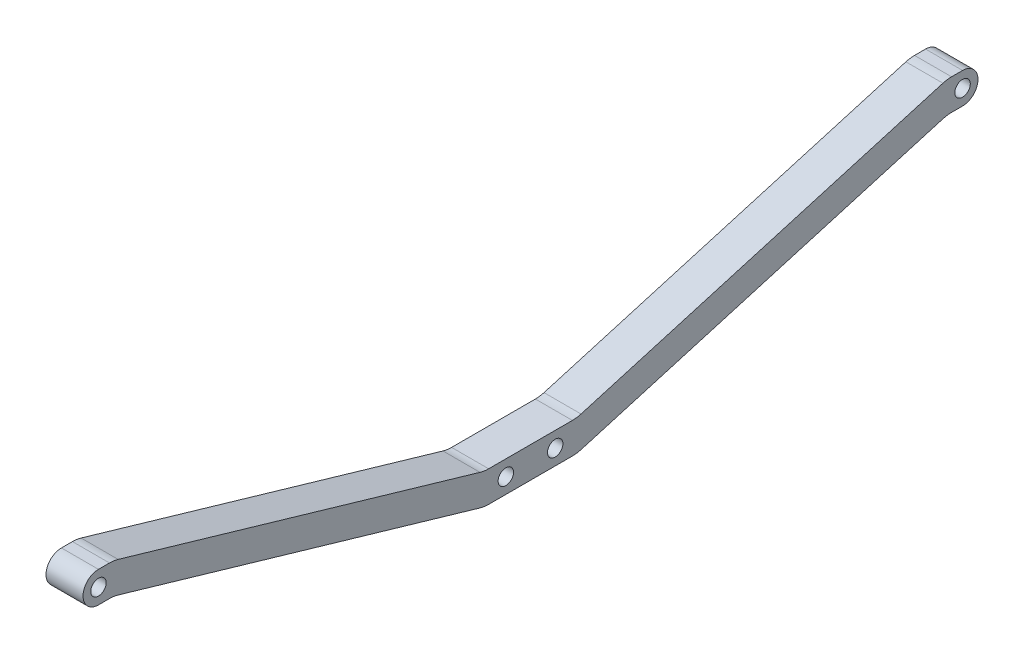
ISO-10303-21;
HEADER;
FILE_DESCRIPTION(('STEP AP214'),'2;1');
FILE_NAME('part.step','',(''),(''),'','','');
FILE_SCHEMA(('AUTOMOTIVE_DESIGN { 1 0 10303 214 1 1 1 1 }'));
ENDSEC;
DATA;
#1=APPLICATION_CONTEXT('core data for automotive mechanical design processes');
#2=APPLICATION_PROTOCOL_DEFINITION('international standard','automotive_design',2000,#1);
#3=PRODUCT_CONTEXT('',#1,'mechanical');
#4=PRODUCT('Part','Part','',(#3));
#5=PRODUCT_RELATED_PRODUCT_CATEGORY('part','',(#4));
#6=PRODUCT_DEFINITION_FORMATION('','',#4);
#7=PRODUCT_DEFINITION_CONTEXT('part definition',#1,'design');
#8=PRODUCT_DEFINITION('design','',#6,#7);
#9=PRODUCT_DEFINITION_SHAPE('','',#8);
#10=(LENGTH_UNIT() NAMED_UNIT(*) SI_UNIT(.MILLI.,.METRE.));
#11=(NAMED_UNIT(*) PLANE_ANGLE_UNIT() SI_UNIT($,.RADIAN.));
#12=(NAMED_UNIT(*) SI_UNIT($,.STERADIAN.) SOLID_ANGLE_UNIT());
#13=UNCERTAINTY_MEASURE_WITH_UNIT(LENGTH_MEASURE(1.E-05),#10,'distance_accuracy_value','');
#14=(GEOMETRIC_REPRESENTATION_CONTEXT(3) GLOBAL_UNCERTAINTY_ASSIGNED_CONTEXT((#13)) GLOBAL_UNIT_ASSIGNED_CONTEXT((#10,
#11,#12)) REPRESENTATION_CONTEXT('',''));
#15=CARTESIAN_POINT('',(0.,0.,0.));
#16=DIRECTION('',(0.,0.,1.));
#17=DIRECTION('',(1.,0.,0.));
#18=AXIS2_PLACEMENT_3D('',#15,#16,#17);
#19=CARTESIAN_POINT('',(12.,0.,-140.));
#20=DIRECTION('',(1.,0.,0.));
#21=DIRECTION('',(0.,0.,-1.));
#22=AXIS2_PLACEMENT_3D('',#19,#20,#21);
#23=PLANE('',#22);
#24=CARTESIAN_POINT('',(12.,0.,140.));
#25=DIRECTION('',(1.,0.,0.));
#26=DIRECTION('',(0.,0.,-1.));
#27=AXIS2_PLACEMENT_3D('',#24,#25,#26);
#28=CIRCLE('',#27,2.5);
#29=CARTESIAN_POINT('',(12.,0.,137.5));
#30=VERTEX_POINT('',#29);
#31=EDGE_CURVE('E684',#30,#30,#28,.T.);
#32=ORIENTED_EDGE('',*,*,#31,.F.);
#33=EDGE_LOOP('',(#32));
#34=FACE_BOUND('',#33,.T.);
#35=CARTESIAN_POINT('',(12.,-35.,8.));
#36=DIRECTION('',(1.,0.,0.));
#37=DIRECTION('',(0.,0.,-1.));
#38=AXIS2_PLACEMENT_3D('',#35,#36,#37);
#39=CIRCLE('',#38,2.5);
#40=CARTESIAN_POINT('',(12.,-35.,5.5));
#41=VERTEX_POINT('',#40);
#42=EDGE_CURVE('E357',#41,#41,#39,.T.);
#43=ORIENTED_EDGE('',*,*,#42,.F.);
#44=EDGE_LOOP('',(#43));
#45=FACE_BOUND('',#44,.T.);
#46=DIRECTION('',(0.,0.,-1.));
#47=VECTOR('',#46,1.);
#48=CARTESIAN_POINT('',(12.,-40.,15.));
#49=LINE('',#48,#47);
#50=CARTESIAN_POINT('',(12.,-40.,13.5714285714286));
#51=VERTEX_POINT('',#50);
#52=CARTESIAN_POINT('',(12.,-40.,-13.5714285714286));
#53=VERTEX_POINT('',#52);
#54=EDGE_CURVE('E339',#51,#53,#49,.T.);
#55=ORIENTED_EDGE('',*,*,#54,.T.);
#56=CARTESIAN_POINT('',(12.,-30.,-13.5714285714286));
#57=DIRECTION('',(1.,0.,0.));
#58=DIRECTION('',(0.,0.,-1.));
#59=AXIS2_PLACEMENT_3D('',#56,#57,#58);
#60=CIRCLE('',#59,10.);
#61=CARTESIAN_POINT('',(12.,-39.6,-16.3714285714286));
#62=VERTEX_POINT('',#61);
#63=EDGE_CURVE('E271',#53,#62,#60,.T.);
#64=ORIENTED_EDGE('',*,*,#63,.T.);
#65=DIRECTION('',(0.,0.28,-0.96));
#66=VECTOR('',#65,1.);
#67=CARTESIAN_POINT('',(12.,-40.,-15.));
#68=LINE('',#67,#66);
#69=CARTESIAN_POINT('',(12.,-5.39999999999999,-133.628571428571));
#70=VERTEX_POINT('',#69);
#71=EDGE_CURVE('E343',#62,#70,#68,.T.);
#72=ORIENTED_EDGE('',*,*,#71,.T.);
#73=CARTESIAN_POINT('',(12.,-15.,-136.428571428571));
#74=DIRECTION('',(1.,0.,0.));
#75=DIRECTION('',(0.,0.,-1.));
#76=AXIS2_PLACEMENT_3D('',#73,#74,#75);
#77=CIRCLE('',#76,10.);
#78=CARTESIAN_POINT('',(12.,-4.99999999999999,-136.428571428571));
#79=VERTEX_POINT('',#78);
#80=EDGE_CURVE('E55',#70,#79,#77,.F.);
#81=ORIENTED_EDGE('',*,*,#80,.T.);
#82=DIRECTION('',(0.,0.,-1.));
#83=VECTOR('',#82,1.);
#84=CARTESIAN_POINT('',(12.,-4.99999999999999,-140.));
#85=LINE('',#84,#83);
#86=CARTESIAN_POINT('',(12.,-4.99999999999999,-140.));
#87=VERTEX_POINT('',#86);
#88=EDGE_CURVE('E196',#79,#87,#85,.T.);
#89=ORIENTED_EDGE('',*,*,#88,.T.);
#90=CARTESIAN_POINT('',(12.,0.,-140.));
#91=DIRECTION('',(1.,0.,0.));
#92=DIRECTION('',(0.,0.,-1.));
#93=AXIS2_PLACEMENT_3D('',#90,#91,#92);
#94=CIRCLE('',#93,4.99999999999999);
#95=CARTESIAN_POINT('',(12.,4.99999999999999,-140.));
#96=VERTEX_POINT('',#95);
#97=EDGE_CURVE('E191',#87,#96,#94,.T.);
#98=ORIENTED_EDGE('',*,*,#97,.T.);
#99=DIRECTION('',(0.,0.,1.));
#100=VECTOR('',#99,1.);
#101=CARTESIAN_POINT('',(12.,4.99999999999999,-140.));
#102=LINE('',#101,#100);
#103=CARTESIAN_POINT('',(12.,4.99999999999999,-136.428571428571));
#104=VERTEX_POINT('',#103);
#105=EDGE_CURVE('E179',#96,#104,#102,.T.);
#106=ORIENTED_EDGE('',*,*,#105,.T.);
#107=CARTESIAN_POINT('',(12.,-5.00000000000001,-136.428571428571));
#108=DIRECTION('',(1.,0.,0.));
#109=DIRECTION('',(0.,0.,-1.));
#110=AXIS2_PLACEMENT_3D('',#107,#108,#109);
#111=CIRCLE('',#110,10.);
#112=CARTESIAN_POINT('',(12.,4.59999999999999,-133.628571428571));
#113=VERTEX_POINT('',#112);
#114=EDGE_CURVE('E265',#104,#113,#111,.T.);
#115=ORIENTED_EDGE('',*,*,#114,.T.);
#116=DIRECTION('',(0.,-0.28,0.96));
#117=VECTOR('',#116,1.);
#118=CARTESIAN_POINT('',(12.,-30.,-15.));
#119=LINE('',#118,#117);
#120=CARTESIAN_POINT('',(12.,-29.6,-16.3714285714286));
#121=VERTEX_POINT('',#120);
#122=EDGE_CURVE('E190',#113,#121,#119,.T.);
#123=ORIENTED_EDGE('',*,*,#122,.T.);
#124=CARTESIAN_POINT('',(12.,-20.,-13.5714285714286));
#125=DIRECTION('',(1.,0.,0.));
#126=DIRECTION('',(0.,0.,-1.));
#127=AXIS2_PLACEMENT_3D('',#124,#125,#126);
#128=CIRCLE('',#127,10.);
#129=CARTESIAN_POINT('',(12.,-30.,-13.5714285714286));
#130=VERTEX_POINT('',#129);
#131=EDGE_CURVE('E296',#121,#130,#128,.F.);
#132=ORIENTED_EDGE('',*,*,#131,.T.);
#133=DIRECTION('',(0.,0.,1.));
#134=VECTOR('',#133,1.);
#135=CARTESIAN_POINT('',(12.,-30.,15.));
#136=LINE('',#135,#134);
#137=CARTESIAN_POINT('',(12.,-30.,13.5714285714286));
#138=VERTEX_POINT('',#137);
#139=EDGE_CURVE('E404',#130,#138,#136,.T.);
#140=ORIENTED_EDGE('',*,*,#139,.T.);
#141=CARTESIAN_POINT('',(12.,-20.,13.5714285714286));
#142=DIRECTION('',(1.,0.,0.));
#143=DIRECTION('',(0.,0.,-1.));
#144=AXIS2_PLACEMENT_3D('',#141,#142,#143);
#145=CIRCLE('',#144,10.);
#146=CARTESIAN_POINT('',(12.,-29.6,16.3714285714286));
#147=VERTEX_POINT('',#146);
#148=EDGE_CURVE('E302',#138,#147,#145,.F.);
#149=ORIENTED_EDGE('',*,*,#148,.T.);
#150=DIRECTION('',(0.,0.28,0.96));
#151=VECTOR('',#150,1.);
#152=CARTESIAN_POINT('',(12.,-30.,15.));
#153=LINE('',#152,#151);
#154=CARTESIAN_POINT('',(12.,4.59999999999999,133.628571428571));
#155=VERTEX_POINT('',#154);
#156=EDGE_CURVE('E408',#147,#155,#153,.T.);
#157=ORIENTED_EDGE('',*,*,#156,.T.);
#158=CARTESIAN_POINT('',(12.,-5.00000000000001,136.428571428571));
#159=DIRECTION('',(1.,0.,0.));
#160=DIRECTION('',(0.,0.,-1.));
#161=AXIS2_PLACEMENT_3D('',#158,#159,#160);
#162=CIRCLE('',#161,10.);
#163=CARTESIAN_POINT('',(12.,4.99999999999999,136.428571428571));
#164=VERTEX_POINT('',#163);
#165=EDGE_CURVE('E262',#155,#164,#162,.T.);
#166=ORIENTED_EDGE('',*,*,#165,.T.);
#167=DIRECTION('',(0.,0.,1.));
#168=VECTOR('',#167,1.);
#169=CARTESIAN_POINT('',(12.,4.99999999999999,140.));
#170=LINE('',#169,#168);
#171=CARTESIAN_POINT('',(12.,4.99999999999999,140.));
#172=VERTEX_POINT('',#171);
#173=EDGE_CURVE('E414',#164,#172,#170,.T.);
#174=ORIENTED_EDGE('',*,*,#173,.T.);
#175=CARTESIAN_POINT('',(12.,0.,140.));
#176=DIRECTION('',(1.,0.,0.));
#177=DIRECTION('',(0.,0.,-1.));
#178=AXIS2_PLACEMENT_3D('',#175,#176,#177);
#179=CIRCLE('',#178,4.99999999999999);
#180=CARTESIAN_POINT('',(12.,-4.99999999999999,140.));
#181=VERTEX_POINT('',#180);
#182=EDGE_CURVE('E345',#172,#181,#179,.T.);
#183=ORIENTED_EDGE('',*,*,#182,.T.);
#184=DIRECTION('',(0.,0.,-1.));
#185=VECTOR('',#184,1.);
#186=CARTESIAN_POINT('',(12.,-4.99999999999999,140.));
#187=LINE('',#186,#185);
#188=CARTESIAN_POINT('',(12.,-4.99999999999999,136.428571428571));
#189=VERTEX_POINT('',#188);
#190=EDGE_CURVE('E336',#181,#189,#187,.T.);
#191=ORIENTED_EDGE('',*,*,#190,.T.);
#192=CARTESIAN_POINT('',(12.,-15.,136.428571428571));
#193=DIRECTION('',(1.,0.,0.));
#194=DIRECTION('',(0.,0.,-1.));
#195=AXIS2_PLACEMENT_3D('',#192,#193,#194);
#196=CIRCLE('',#195,10.);
#197=CARTESIAN_POINT('',(12.,-5.4,133.628571428571));
#198=VERTEX_POINT('',#197);
#199=EDGE_CURVE('E11',#189,#198,#196,.F.);
#200=ORIENTED_EDGE('',*,*,#199,.T.);
#201=DIRECTION('',(0.,-0.28,-0.96));
#202=VECTOR('',#201,1.);
#203=CARTESIAN_POINT('',(12.,-40.,15.));
#204=LINE('',#203,#202);
#205=CARTESIAN_POINT('',(12.,-39.6,16.3714285714286));
#206=VERTEX_POINT('',#205);
#207=EDGE_CURVE('E334',#198,#206,#204,.T.);
#208=ORIENTED_EDGE('',*,*,#207,.T.);
#209=CARTESIAN_POINT('',(12.,-30.,13.5714285714286));
#210=DIRECTION('',(1.,0.,0.));
#211=DIRECTION('',(0.,0.,-1.));
#212=AXIS2_PLACEMENT_3D('',#209,#210,#211);
#213=CIRCLE('',#212,10.);
#214=EDGE_CURVE('E268',#206,#51,#213,.T.);
#215=ORIENTED_EDGE('',*,*,#214,.T.);
#216=EDGE_LOOP('',(#55,#64,#72,#81,#89,#98,#106,#115,#123,#132,#140,#149,#157,#166,#174,#183,
#191,#200,#208,#215));
#217=FACE_BOUND('',#216,.T.);
#218=CARTESIAN_POINT('',(12.,-35.,-8.));
#219=DIRECTION('',(1.,0.,0.));
#220=DIRECTION('',(0.,0.,-1.));
#221=AXIS2_PLACEMENT_3D('',#218,#219,#220);
#222=CIRCLE('',#221,2.5);
#223=CARTESIAN_POINT('',(12.,-35.,-10.5));
#224=VERTEX_POINT('',#223);
#225=EDGE_CURVE('E701',#224,#224,#222,.T.);
#226=ORIENTED_EDGE('',*,*,#225,.F.);
#227=EDGE_LOOP('',(#226));
#228=FACE_BOUND('',#227,.T.);
#229=CARTESIAN_POINT('',(12.,0.,-140.));
#230=DIRECTION('',(1.,0.,0.));
#231=DIRECTION('',(0.,0.,-1.));
#232=AXIS2_PLACEMENT_3D('',#229,#230,#231);
#233=CIRCLE('',#232,2.5);
#234=CARTESIAN_POINT('',(12.,0.,-142.5));
#235=VERTEX_POINT('',#234);
#236=EDGE_CURVE('E690',#235,#235,#233,.T.);
#237=ORIENTED_EDGE('',*,*,#236,.F.);
#238=EDGE_LOOP('',(#237));
#239=FACE_BOUND('',#238,.T.);
#240=ADVANCED_FACE('F39',(#34,#45,#217,#228,#239),#23,.T.);
#241=CARTESIAN_POINT('',(0.,0.,-140.));
#242=DIRECTION('',(1.,0.,0.));
#243=DIRECTION('',(0.,0.,-1.));
#244=AXIS2_PLACEMENT_3D('',#241,#242,#243);
#245=PLANE('',#244);
#246=DIRECTION('',(0.,0.28,-0.96));
#247=VECTOR('',#246,1.);
#248=CARTESIAN_POINT('',(0.,-40.,-15.));
#249=LINE('',#248,#247);
#250=CARTESIAN_POINT('',(0.,-39.6,-16.3714285714286));
#251=VERTEX_POINT('',#250);
#252=CARTESIAN_POINT('',(0.,-5.39999999999999,-133.628571428571));
#253=VERTEX_POINT('',#252);
#254=EDGE_CURVE('E383',#251,#253,#249,.T.);
#255=ORIENTED_EDGE('',*,*,#254,.F.);
#256=CARTESIAN_POINT('',(0.,-30.,-13.5714285714286));
#257=DIRECTION('',(1.,0.,0.));
#258=DIRECTION('',(0.,0.,-1.));
#259=AXIS2_PLACEMENT_3D('',#256,#257,#258);
#260=CIRCLE('',#259,10.);
#261=CARTESIAN_POINT('',(0.,-40.,-13.5714285714286));
#262=VERTEX_POINT('',#261);
#263=EDGE_CURVE('E252',#251,#262,#260,.F.);
#264=ORIENTED_EDGE('',*,*,#263,.T.);
#265=DIRECTION('',(0.,0.,-1.));
#266=VECTOR('',#265,1.);
#267=CARTESIAN_POINT('',(0.,-40.,15.));
#268=LINE('',#267,#266);
#269=CARTESIAN_POINT('',(0.,-40.,13.5714285714286));
#270=VERTEX_POINT('',#269);
#271=EDGE_CURVE('E379',#270,#262,#268,.T.);
#272=ORIENTED_EDGE('',*,*,#271,.F.);
#273=CARTESIAN_POINT('',(0.,-30.,13.5714285714286));
#274=DIRECTION('',(1.,0.,0.));
#275=DIRECTION('',(0.,0.,-1.));
#276=AXIS2_PLACEMENT_3D('',#273,#274,#275);
#277=CIRCLE('',#276,10.);
#278=CARTESIAN_POINT('',(0.,-39.6,16.3714285714286));
#279=VERTEX_POINT('',#278);
#280=EDGE_CURVE('E249',#270,#279,#277,.F.);
#281=ORIENTED_EDGE('',*,*,#280,.T.);
#282=DIRECTION('',(0.,-0.28,-0.96));
#283=VECTOR('',#282,1.);
#284=CARTESIAN_POINT('',(0.,-40.,15.));
#285=LINE('',#284,#283);
#286=CARTESIAN_POINT('',(0.,-5.4,133.628571428571));
#287=VERTEX_POINT('',#286);
#288=EDGE_CURVE('E319',#287,#279,#285,.T.);
#289=ORIENTED_EDGE('',*,*,#288,.F.);
#290=CARTESIAN_POINT('',(0.,-15.,136.428571428571));
#291=DIRECTION('',(1.,0.,0.));
#292=DIRECTION('',(0.,0.,-1.));
#293=AXIS2_PLACEMENT_3D('',#290,#291,#292);
#294=CIRCLE('',#293,10.);
#295=CARTESIAN_POINT('',(0.,-4.99999999999999,136.428571428571));
#296=VERTEX_POINT('',#295);
#297=EDGE_CURVE('E48',#287,#296,#294,.T.);
#298=ORIENTED_EDGE('',*,*,#297,.T.);
#299=DIRECTION('',(0.,0.,-1.));
#300=VECTOR('',#299,1.);
#301=CARTESIAN_POINT('',(0.,-4.99999999999999,140.));
#302=LINE('',#301,#300);
#303=CARTESIAN_POINT('',(0.,-4.99999999999999,140.));
#304=VERTEX_POINT('',#303);
#305=EDGE_CURVE('E318',#304,#296,#302,.T.);
#306=ORIENTED_EDGE('',*,*,#305,.F.);
#307=CARTESIAN_POINT('',(0.,0.,140.));
#308=DIRECTION('',(1.,0.,0.));
#309=DIRECTION('',(0.,0.,-1.));
#310=AXIS2_PLACEMENT_3D('',#307,#308,#309);
#311=CIRCLE('',#310,4.99999999999999);
#312=CARTESIAN_POINT('',(0.,4.99999999999999,140.));
#313=VERTEX_POINT('',#312);
#314=EDGE_CURVE('E330',#313,#304,#311,.T.);
#315=ORIENTED_EDGE('',*,*,#314,.F.);
#316=DIRECTION('',(0.,0.,1.));
#317=VECTOR('',#316,1.);
#318=CARTESIAN_POINT('',(0.,4.99999999999999,140.));
#319=LINE('',#318,#317);
#320=CARTESIAN_POINT('',(0.,4.99999999999999,136.428571428571));
#321=VERTEX_POINT('',#320);
#322=EDGE_CURVE('E372',#321,#313,#319,.T.);
#323=ORIENTED_EDGE('',*,*,#322,.F.);
#324=CARTESIAN_POINT('',(0.,-5.00000000000001,136.428571428571));
#325=DIRECTION('',(1.,0.,0.));
#326=DIRECTION('',(0.,0.,-1.));
#327=AXIS2_PLACEMENT_3D('',#324,#325,#326);
#328=CIRCLE('',#327,10.);
#329=CARTESIAN_POINT('',(0.,4.59999999999999,133.628571428571));
#330=VERTEX_POINT('',#329);
#331=EDGE_CURVE('E243',#321,#330,#328,.F.);
#332=ORIENTED_EDGE('',*,*,#331,.T.);
#333=DIRECTION('',(0.,0.28,0.96));
#334=VECTOR('',#333,1.);
#335=CARTESIAN_POINT('',(0.,-30.,15.));
#336=LINE('',#335,#334);
#337=CARTESIAN_POINT('',(0.,-29.6,16.3714285714286));
#338=VERTEX_POINT('',#337);
#339=EDGE_CURVE('E368',#338,#330,#336,.T.);
#340=ORIENTED_EDGE('',*,*,#339,.F.);
#341=CARTESIAN_POINT('',(0.,-20.,13.5714285714286));
#342=DIRECTION('',(1.,0.,0.));
#343=DIRECTION('',(0.,0.,-1.));
#344=AXIS2_PLACEMENT_3D('',#341,#342,#343);
#345=CIRCLE('',#344,10.);
#346=CARTESIAN_POINT('',(0.,-30.,13.5714285714286));
#347=VERTEX_POINT('',#346);
#348=EDGE_CURVE('E299',#338,#347,#345,.T.);
#349=ORIENTED_EDGE('',*,*,#348,.T.);
#350=DIRECTION('',(0.,0.,1.));
#351=VECTOR('',#350,1.);
#352=CARTESIAN_POINT('',(0.,-30.,15.));
#353=LINE('',#352,#351);
#354=CARTESIAN_POINT('',(0.,-30.,-13.5714285714286));
#355=VERTEX_POINT('',#354);
#356=EDGE_CURVE('E364',#355,#347,#353,.T.);
#357=ORIENTED_EDGE('',*,*,#356,.F.);
#358=CARTESIAN_POINT('',(0.,-20.,-13.5714285714286));
#359=DIRECTION('',(1.,0.,0.));
#360=DIRECTION('',(0.,0.,-1.));
#361=AXIS2_PLACEMENT_3D('',#358,#359,#360);
#362=CIRCLE('',#361,10.);
#363=CARTESIAN_POINT('',(0.,-29.6,-16.3714285714286));
#364=VERTEX_POINT('',#363);
#365=EDGE_CURVE('E293',#355,#364,#362,.T.);
#366=ORIENTED_EDGE('',*,*,#365,.T.);
#367=DIRECTION('',(0.,-0.28,0.96));
#368=VECTOR('',#367,1.);
#369=CARTESIAN_POINT('',(0.,-30.,-15.));
#370=LINE('',#369,#368);
#371=CARTESIAN_POINT('',(0.,4.59999999999999,-133.628571428571));
#372=VERTEX_POINT('',#371);
#373=EDGE_CURVE('E360',#372,#364,#370,.T.);
#374=ORIENTED_EDGE('',*,*,#373,.F.);
#375=CARTESIAN_POINT('',(0.,-5.00000000000001,-136.428571428571));
#376=DIRECTION('',(1.,0.,0.));
#377=DIRECTION('',(0.,0.,-1.));
#378=AXIS2_PLACEMENT_3D('',#375,#376,#377);
#379=CIRCLE('',#378,10.);
#380=CARTESIAN_POINT('',(0.,4.99999999999999,-136.428571428571));
#381=VERTEX_POINT('',#380);
#382=EDGE_CURVE('E246',#372,#381,#379,.F.);
#383=ORIENTED_EDGE('',*,*,#382,.T.);
#384=DIRECTION('',(0.,0.,1.));
#385=VECTOR('',#384,1.);
#386=CARTESIAN_POINT('',(0.,4.99999999999999,-140.));
#387=LINE('',#386,#385);
#388=CARTESIAN_POINT('',(0.,4.99999999999999,-140.));
#389=VERTEX_POINT('',#388);
#390=EDGE_CURVE('E356',#389,#381,#387,.T.);
#391=ORIENTED_EDGE('',*,*,#390,.F.);
#392=CARTESIAN_POINT('',(0.,0.,-140.));
#393=DIRECTION('',(1.,0.,0.));
#394=DIRECTION('',(0.,0.,-1.));
#395=AXIS2_PLACEMENT_3D('',#392,#393,#394);
#396=CIRCLE('',#395,4.99999999999999);
#397=CARTESIAN_POINT('',(0.,-4.99999999999999,-140.));
#398=VERTEX_POINT('',#397);
#399=EDGE_CURVE('E205',#398,#389,#396,.T.);
#400=ORIENTED_EDGE('',*,*,#399,.F.);
#401=DIRECTION('',(0.,0.,-1.));
#402=VECTOR('',#401,1.);
#403=CARTESIAN_POINT('',(0.,-4.99999999999999,-140.));
#404=LINE('',#403,#402);
#405=CARTESIAN_POINT('',(0.,-4.99999999999999,-136.428571428571));
#406=VERTEX_POINT('',#405);
#407=EDGE_CURVE('E201',#406,#398,#404,.T.);
#408=ORIENTED_EDGE('',*,*,#407,.F.);
#409=CARTESIAN_POINT('',(0.,-15.,-136.428571428571));
#410=DIRECTION('',(1.,0.,0.));
#411=DIRECTION('',(0.,0.,-1.));
#412=AXIS2_PLACEMENT_3D('',#409,#410,#411);
#413=CIRCLE('',#412,10.);
#414=EDGE_CURVE('E305',#406,#253,#413,.T.);
#415=ORIENTED_EDGE('',*,*,#414,.T.);
#416=EDGE_LOOP('',(#255,#264,#272,#281,#289,#298,#306,#315,#323,#332,#340,#349,#357,#366,#374,
#383,#391,#400,#408,#415));
#417=FACE_BOUND('',#416,.T.);
#418=CARTESIAN_POINT('',(0.,-35.,8.));
#419=DIRECTION('',(1.,0.,0.));
#420=DIRECTION('',(0.,0.,-1.));
#421=AXIS2_PLACEMENT_3D('',#418,#419,#420);
#422=CIRCLE('',#421,2.5);
#423=CARTESIAN_POINT('',(0.,-35.,5.5));
#424=VERTEX_POINT('',#423);
#425=EDGE_CURVE('E705',#424,#424,#422,.T.);
#426=ORIENTED_EDGE('',*,*,#425,.T.);
#427=EDGE_LOOP('',(#426));
#428=FACE_BOUND('',#427,.T.);
#429=CARTESIAN_POINT('',(0.,-35.,-8.));
#430=DIRECTION('',(1.,0.,0.));
#431=DIRECTION('',(0.,0.,-1.));
#432=AXIS2_PLACEMENT_3D('',#429,#430,#431);
#433=CIRCLE('',#432,2.5);
#434=CARTESIAN_POINT('',(0.,-35.,-10.5));
#435=VERTEX_POINT('',#434);
#436=EDGE_CURVE('E694',#435,#435,#433,.T.);
#437=ORIENTED_EDGE('',*,*,#436,.T.);
#438=EDGE_LOOP('',(#437));
#439=FACE_BOUND('',#438,.T.);
#440=CARTESIAN_POINT('',(0.,0.,140.));
#441=DIRECTION('',(1.,0.,0.));
#442=DIRECTION('',(0.,0.,-1.));
#443=AXIS2_PLACEMENT_3D('',#440,#441,#442);
#444=CIRCLE('',#443,2.5);
#445=CARTESIAN_POINT('',(0.,0.,137.5));
#446=VERTEX_POINT('',#445);
#447=EDGE_CURVE('E687',#446,#446,#444,.T.);
#448=ORIENTED_EDGE('',*,*,#447,.T.);
#449=EDGE_LOOP('',(#448));
#450=FACE_BOUND('',#449,.T.);
#451=CARTESIAN_POINT('',(0.,0.,-140.));
#452=DIRECTION('',(1.,0.,0.));
#453=DIRECTION('',(0.,0.,-1.));
#454=AXIS2_PLACEMENT_3D('',#451,#452,#453);
#455=CIRCLE('',#454,2.5);
#456=CARTESIAN_POINT('',(0.,0.,-142.5));
#457=VERTEX_POINT('',#456);
#458=EDGE_CURVE('E697',#457,#457,#455,.T.);
#459=ORIENTED_EDGE('',*,*,#458,.T.);
#460=EDGE_LOOP('',(#459));
#461=FACE_BOUND('',#460,.T.);
#462=ADVANCED_FACE('F315',(#417,#428,#439,#450,#461),#245,.F.);
#463=CARTESIAN_POINT('',(12.,0.,-140.));
#464=DIRECTION('',(-1.,0.,0.));
#465=DIRECTION('',(0.,0.,1.));
#466=AXIS2_PLACEMENT_3D('',#463,#464,#465);
#467=CYLINDRICAL_SURFACE('',#466,4.99999999999999);
#468=ORIENTED_EDGE('',*,*,#399,.T.);
#469=DIRECTION('',(-1.,0.,0.));
#470=VECTOR('',#469,1.);
#471=CARTESIAN_POINT('',(12.,4.99999999999999,-140.));
#472=LINE('',#471,#470);
#473=EDGE_CURVE('E184',#96,#389,#472,.T.);
#474=ORIENTED_EDGE('',*,*,#473,.F.);
#475=ORIENTED_EDGE('',*,*,#97,.F.);
#476=DIRECTION('',(-1.,0.,0.));
#477=VECTOR('',#476,1.);
#478=CARTESIAN_POINT('',(12.,-4.99999999999999,-140.));
#479=LINE('',#478,#477);
#480=EDGE_CURVE('E353',#87,#398,#479,.T.);
#481=ORIENTED_EDGE('',*,*,#480,.T.);
#482=EDGE_LOOP('',(#468,#474,#475,#481));
#483=FACE_BOUND('',#482,.T.);
#484=ADVANCED_FACE('F203',(#483),#467,.T.);
#485=CARTESIAN_POINT('',(12.,4.99999999999999,-140.));
#486=DIRECTION('',(0.,-1.,0.));
#487=DIRECTION('',(0.,0.,-1.));
#488=AXIS2_PLACEMENT_3D('',#485,#486,#487);
#489=PLANE('',#488);
#490=ORIENTED_EDGE('',*,*,#390,.T.);
#491=DIRECTION('',(-1.,0.,0.));
#492=VECTOR('',#491,1.);
#493=CARTESIAN_POINT('',(12.,4.99999999999999,-136.428571428571));
#494=LINE('',#493,#492);
#495=EDGE_CURVE('E187',#381,#104,#494,.F.);
#496=ORIENTED_EDGE('',*,*,#495,.T.);
#497=ORIENTED_EDGE('',*,*,#105,.F.);
#498=ORIENTED_EDGE('',*,*,#473,.T.);
#499=EDGE_LOOP('',(#490,#496,#497,#498));
#500=FACE_BOUND('',#499,.T.);
#501=ADVANCED_FACE('F182',(#500),#489,.F.);
#502=CARTESIAN_POINT('',(12.,-30.,-15.));
#503=DIRECTION('',(0.,-0.96,-0.28));
#504=DIRECTION('',(0.,0.28,-0.96));
#505=AXIS2_PLACEMENT_3D('',#502,#503,#504);
#506=PLANE('',#505);
#507=ORIENTED_EDGE('',*,*,#373,.T.);
#508=DIRECTION('',(-1.,0.,0.));
#509=VECTOR('',#508,1.);
#510=CARTESIAN_POINT('',(12.,-29.6,-16.3714285714286));
#511=LINE('',#510,#509);
#512=EDGE_CURVE('E226',#364,#121,#511,.F.);
#513=ORIENTED_EDGE('',*,*,#512,.T.);
#514=ORIENTED_EDGE('',*,*,#122,.F.);
#515=DIRECTION('',(-1.,0.,0.));
#516=VECTOR('',#515,1.);
#517=CARTESIAN_POINT('',(12.,4.59999999999999,-133.628571428571));
#518=LINE('',#517,#516);
#519=EDGE_CURVE('E222',#113,#372,#518,.T.);
#520=ORIENTED_EDGE('',*,*,#519,.T.);
#521=EDGE_LOOP('',(#507,#513,#514,#520));
#522=FACE_BOUND('',#521,.T.);
#523=ADVANCED_FACE('F401',(#522),#506,.F.);
#524=CARTESIAN_POINT('',(12.,-30.,15.));
#525=DIRECTION('',(0.,-1.,0.));
#526=DIRECTION('',(0.,0.,-1.));
#527=AXIS2_PLACEMENT_3D('',#524,#525,#526);
#528=PLANE('',#527);
#529=ORIENTED_EDGE('',*,*,#139,.F.);
#530=DIRECTION('',(-1.,0.,0.));
#531=VECTOR('',#530,1.);
#532=CARTESIAN_POINT('',(0.,-30.,-13.5714285714286));
#533=LINE('',#532,#531);
#534=EDGE_CURVE('E212',#130,#355,#533,.T.);
#535=ORIENTED_EDGE('',*,*,#534,.T.);
#536=ORIENTED_EDGE('',*,*,#356,.T.);
#537=DIRECTION('',(-1.,0.,0.));
#538=VECTOR('',#537,1.);
#539=CARTESIAN_POINT('',(12.,-30.,13.5714285714286));
#540=LINE('',#539,#538);
#541=EDGE_CURVE('E207',#347,#138,#540,.F.);
#542=ORIENTED_EDGE('',*,*,#541,.T.);
#543=EDGE_LOOP('',(#529,#535,#536,#542));
#544=FACE_BOUND('',#543,.T.);
#545=ADVANCED_FACE('F441',(#544),#528,.F.);
#546=CARTESIAN_POINT('',(12.,-30.,15.));
#547=DIRECTION('',(0.,-0.96,0.28));
#548=DIRECTION('',(0.,-0.28,-0.96));
#549=AXIS2_PLACEMENT_3D('',#546,#547,#548);
#550=PLANE('',#549);
#551=ORIENTED_EDGE('',*,*,#156,.F.);
#552=DIRECTION('',(-1.,0.,0.));
#553=VECTOR('',#552,1.);
#554=CARTESIAN_POINT('',(0.,-29.6,16.3714285714286));
#555=LINE('',#554,#553);
#556=EDGE_CURVE('E232',#147,#338,#555,.T.);
#557=ORIENTED_EDGE('',*,*,#556,.T.);
#558=ORIENTED_EDGE('',*,*,#339,.T.);
#559=DIRECTION('',(-1.,0.,0.));
#560=VECTOR('',#559,1.);
#561=CARTESIAN_POINT('',(12.,4.59999999999998,133.628571428571));
#562=LINE('',#561,#560);
#563=EDGE_CURVE('E229',#330,#155,#562,.F.);
#564=ORIENTED_EDGE('',*,*,#563,.T.);
#565=EDGE_LOOP('',(#551,#557,#558,#564));
#566=FACE_BOUND('',#565,.T.);
#567=ADVANCED_FACE('F432',(#566),#550,.F.);
#568=CARTESIAN_POINT('',(12.,4.99999999999999,140.));
#569=DIRECTION('',(0.,-1.,0.));
#570=DIRECTION('',(0.,0.,-1.));
#571=AXIS2_PLACEMENT_3D('',#568,#569,#570);
#572=PLANE('',#571);
#573=ORIENTED_EDGE('',*,*,#173,.F.);
#574=DIRECTION('',(-1.,0.,0.));
#575=VECTOR('',#574,1.);
#576=CARTESIAN_POINT('',(12.,4.99999999999999,136.428571428571));
#577=LINE('',#576,#575);
#578=EDGE_CURVE('E289',#164,#321,#577,.T.);
#579=ORIENTED_EDGE('',*,*,#578,.T.);
#580=ORIENTED_EDGE('',*,*,#322,.T.);
#581=DIRECTION('',(-1.,0.,0.));
#582=VECTOR('',#581,1.);
#583=CARTESIAN_POINT('',(12.,4.99999999999999,140.));
#584=LINE('',#583,#582);
#585=EDGE_CURVE('E208',#172,#313,#584,.T.);
#586=ORIENTED_EDGE('',*,*,#585,.F.);
#587=EDGE_LOOP('',(#573,#579,#580,#586));
#588=FACE_BOUND('',#587,.T.);
#589=ADVANCED_FACE('F425',(#588),#572,.F.);
#590=CARTESIAN_POINT('',(12.,0.,140.));
#591=DIRECTION('',(-1.,0.,0.));
#592=DIRECTION('',(0.,0.,1.));
#593=AXIS2_PLACEMENT_3D('',#590,#591,#592);
#594=CYLINDRICAL_SURFACE('',#593,4.99999999999999);
#595=ORIENTED_EDGE('',*,*,#314,.T.);
#596=DIRECTION('',(-1.,0.,0.));
#597=VECTOR('',#596,1.);
#598=CARTESIAN_POINT('',(12.,-4.99999999999999,140.));
#599=LINE('',#598,#597);
#600=EDGE_CURVE('E215',#181,#304,#599,.T.);
#601=ORIENTED_EDGE('',*,*,#600,.F.);
#602=ORIENTED_EDGE('',*,*,#182,.F.);
#603=ORIENTED_EDGE('',*,*,#585,.T.);
#604=EDGE_LOOP('',(#595,#601,#602,#603));
#605=FACE_BOUND('',#604,.T.);
#606=ADVANCED_FACE('F421',(#605),#594,.T.);
#607=CARTESIAN_POINT('',(12.,-4.99999999999999,140.));
#608=DIRECTION('',(0.,1.,0.));
#609=DIRECTION('',(0.,0.,1.));
#610=AXIS2_PLACEMENT_3D('',#607,#608,#609);
#611=PLANE('',#610);
#612=ORIENTED_EDGE('',*,*,#305,.T.);
#613=DIRECTION('',(-1.,0.,0.));
#614=VECTOR('',#613,1.);
#615=CARTESIAN_POINT('',(12.,-4.99999999999999,136.428571428571));
#616=LINE('',#615,#614);
#617=EDGE_CURVE('E286',#296,#189,#616,.F.);
#618=ORIENTED_EDGE('',*,*,#617,.T.);
#619=ORIENTED_EDGE('',*,*,#190,.F.);
#620=ORIENTED_EDGE('',*,*,#600,.T.);
#621=EDGE_LOOP('',(#612,#618,#619,#620));
#622=FACE_BOUND('',#621,.T.);
#623=ADVANCED_FACE('F325',(#622),#611,.F.);
#624=CARTESIAN_POINT('',(12.,-40.,15.));
#625=DIRECTION('',(0.,0.96,-0.28));
#626=DIRECTION('',(0.,0.28,0.96));
#627=AXIS2_PLACEMENT_3D('',#624,#625,#626);
#628=PLANE('',#627);
#629=ORIENTED_EDGE('',*,*,#288,.T.);
#630=DIRECTION('',(-1.,0.,0.));
#631=VECTOR('',#630,1.);
#632=CARTESIAN_POINT('',(12.,-39.6,16.3714285714286));
#633=LINE('',#632,#631);
#634=EDGE_CURVE('E63',#279,#206,#633,.F.);
#635=ORIENTED_EDGE('',*,*,#634,.T.);
#636=ORIENTED_EDGE('',*,*,#207,.F.);
#637=DIRECTION('',(-1.,0.,0.));
#638=VECTOR('',#637,1.);
#639=CARTESIAN_POINT('',(0.,-5.4,133.628571428571));
#640=LINE('',#639,#638);
#641=EDGE_CURVE('E274',#198,#287,#640,.T.);
#642=ORIENTED_EDGE('',*,*,#641,.T.);
#643=EDGE_LOOP('',(#629,#635,#636,#642));
#644=FACE_BOUND('',#643,.T.);
#645=ADVANCED_FACE('F337',(#644),#628,.F.);
#646=CARTESIAN_POINT('',(12.,-40.,15.));
#647=DIRECTION('',(0.,1.,0.));
#648=DIRECTION('',(0.,0.,1.));
#649=AXIS2_PLACEMENT_3D('',#646,#647,#648);
#650=PLANE('',#649);
#651=ORIENTED_EDGE('',*,*,#271,.T.);
#652=DIRECTION('',(-1.,0.,0.));
#653=VECTOR('',#652,1.);
#654=CARTESIAN_POINT('',(12.,-40.,-13.5714285714286));
#655=LINE('',#654,#653);
#656=EDGE_CURVE('E259',#262,#53,#655,.F.);
#657=ORIENTED_EDGE('',*,*,#656,.T.);
#658=ORIENTED_EDGE('',*,*,#54,.F.);
#659=DIRECTION('',(-1.,0.,0.));
#660=VECTOR('',#659,1.);
#661=CARTESIAN_POINT('',(12.,-40.,13.5714285714286));
#662=LINE('',#661,#660);
#663=EDGE_CURVE('E255',#51,#270,#662,.T.);
#664=ORIENTED_EDGE('',*,*,#663,.T.);
#665=EDGE_LOOP('',(#651,#657,#658,#664));
#666=FACE_BOUND('',#665,.T.);
#667=ADVANCED_FACE('F477',(#666),#650,.F.);
#668=CARTESIAN_POINT('',(12.,-40.,-15.));
#669=DIRECTION('',(0.,0.96,0.28));
#670=DIRECTION('',(0.,-0.28,0.96));
#671=AXIS2_PLACEMENT_3D('',#668,#669,#670);
#672=PLANE('',#671);
#673=ORIENTED_EDGE('',*,*,#71,.F.);
#674=DIRECTION('',(-1.,0.,0.));
#675=VECTOR('',#674,1.);
#676=CARTESIAN_POINT('',(12.,-39.6,-16.3714285714286));
#677=LINE('',#676,#675);
#678=EDGE_CURVE('E239',#62,#251,#677,.T.);
#679=ORIENTED_EDGE('',*,*,#678,.T.);
#680=ORIENTED_EDGE('',*,*,#254,.T.);
#681=DIRECTION('',(-1.,0.,0.));
#682=VECTOR('',#681,1.);
#683=CARTESIAN_POINT('',(12.,-5.39999999999999,-133.628571428571));
#684=LINE('',#683,#682);
#685=EDGE_CURVE('E236',#253,#70,#684,.F.);
#686=ORIENTED_EDGE('',*,*,#685,.T.);
#687=EDGE_LOOP('',(#673,#679,#680,#686));
#688=FACE_BOUND('',#687,.T.);
#689=ADVANCED_FACE('F474',(#688),#672,.F.);
#690=CARTESIAN_POINT('',(12.,-4.99999999999999,-140.));
#691=DIRECTION('',(0.,1.,0.));
#692=DIRECTION('',(0.,0.,1.));
#693=AXIS2_PLACEMENT_3D('',#690,#691,#692);
#694=PLANE('',#693);
#695=ORIENTED_EDGE('',*,*,#88,.F.);
#696=DIRECTION('',(-1.,0.,0.));
#697=VECTOR('',#696,1.);
#698=CARTESIAN_POINT('',(0.,-4.99999999999999,-136.428571428571));
#699=LINE('',#698,#697);
#700=EDGE_CURVE('E280',#79,#406,#699,.T.);
#701=ORIENTED_EDGE('',*,*,#700,.T.);
#702=ORIENTED_EDGE('',*,*,#407,.T.);
#703=ORIENTED_EDGE('',*,*,#480,.F.);
#704=EDGE_LOOP('',(#695,#701,#702,#703));
#705=FACE_BOUND('',#704,.T.);
#706=ADVANCED_FACE('F471',(#705),#694,.F.);
#707=CARTESIAN_POINT('',(12.,-35.,8.));
#708=DIRECTION('',(-1.,0.,0.));
#709=DIRECTION('',(0.,0.,1.));
#710=AXIS2_PLACEMENT_3D('',#707,#708,#709);
#711=CYLINDRICAL_SURFACE('',#710,2.5);
#712=ORIENTED_EDGE('',*,*,#42,.T.);
#713=EDGE_LOOP('',(#712));
#714=FACE_BOUND('',#713,.T.);
#715=ORIENTED_EDGE('',*,*,#425,.F.);
#716=EDGE_LOOP('',(#715));
#717=FACE_BOUND('',#716,.T.);
#718=ADVANCED_FACE('F468',(#714,#717),#711,.F.);
#719=CARTESIAN_POINT('',(12.,-35.,-8.));
#720=DIRECTION('',(-1.,0.,0.));
#721=DIRECTION('',(0.,0.,1.));
#722=AXIS2_PLACEMENT_3D('',#719,#720,#721);
#723=CYLINDRICAL_SURFACE('',#722,2.5);
#724=ORIENTED_EDGE('',*,*,#225,.T.);
#725=EDGE_LOOP('',(#724));
#726=FACE_BOUND('',#725,.T.);
#727=ORIENTED_EDGE('',*,*,#436,.F.);
#728=EDGE_LOOP('',(#727));
#729=FACE_BOUND('',#728,.T.);
#730=ADVANCED_FACE('F552',(#726,#729),#723,.F.);
#731=CARTESIAN_POINT('',(12.,0.,140.));
#732=DIRECTION('',(-1.,0.,0.));
#733=DIRECTION('',(0.,0.,1.));
#734=AXIS2_PLACEMENT_3D('',#731,#732,#733);
#735=CYLINDRICAL_SURFACE('',#734,2.5);
#736=ORIENTED_EDGE('',*,*,#31,.T.);
#737=EDGE_LOOP('',(#736));
#738=FACE_BOUND('',#737,.T.);
#739=ORIENTED_EDGE('',*,*,#447,.F.);
#740=EDGE_LOOP('',(#739));
#741=FACE_BOUND('',#740,.T.);
#742=ADVANCED_FACE('F454',(#738,#741),#735,.F.);
#743=CARTESIAN_POINT('',(12.,0.,-140.));
#744=DIRECTION('',(-1.,0.,0.));
#745=DIRECTION('',(0.,0.,1.));
#746=AXIS2_PLACEMENT_3D('',#743,#744,#745);
#747=CYLINDRICAL_SURFACE('',#746,2.5);
#748=ORIENTED_EDGE('',*,*,#236,.T.);
#749=EDGE_LOOP('',(#748));
#750=FACE_BOUND('',#749,.T.);
#751=ORIENTED_EDGE('',*,*,#458,.F.);
#752=EDGE_LOOP('',(#751));
#753=FACE_BOUND('',#752,.T.);
#754=ADVANCED_FACE('F446',(#750,#753),#747,.F.);
#755=CARTESIAN_POINT('',(12.,-20.,-13.5714285714286));
#756=DIRECTION('',(1.,0.,0.));
#757=DIRECTION('',(0.,0.,-1.));
#758=AXIS2_PLACEMENT_3D('',#755,#756,#757);
#759=CYLINDRICAL_SURFACE('',#758,10.);
#760=ORIENTED_EDGE('',*,*,#131,.F.);
#761=ORIENTED_EDGE('',*,*,#512,.F.);
#762=ORIENTED_EDGE('',*,*,#365,.F.);
#763=ORIENTED_EDGE('',*,*,#534,.F.);
#764=EDGE_LOOP('',(#760,#761,#762,#763));
#765=FACE_BOUND('',#764,.T.);
#766=ADVANCED_FACE('F444',(#765),#759,.F.);
#767=CARTESIAN_POINT('',(12.,-20.,13.5714285714286));
#768=DIRECTION('',(1.,0.,0.));
#769=DIRECTION('',(0.,0.,-1.));
#770=AXIS2_PLACEMENT_3D('',#767,#768,#769);
#771=CYLINDRICAL_SURFACE('',#770,10.);
#772=ORIENTED_EDGE('',*,*,#148,.F.);
#773=ORIENTED_EDGE('',*,*,#541,.F.);
#774=ORIENTED_EDGE('',*,*,#348,.F.);
#775=ORIENTED_EDGE('',*,*,#556,.F.);
#776=EDGE_LOOP('',(#772,#773,#774,#775));
#777=FACE_BOUND('',#776,.T.);
#778=ADVANCED_FACE('F438',(#777),#771,.F.);
#779=CARTESIAN_POINT('',(12.,-30.,-13.5714285714286));
#780=DIRECTION('',(-1.,0.,0.));
#781=DIRECTION('',(0.,0.,1.));
#782=AXIS2_PLACEMENT_3D('',#779,#780,#781);
#783=CYLINDRICAL_SURFACE('',#782,10.);
#784=ORIENTED_EDGE('',*,*,#63,.F.);
#785=ORIENTED_EDGE('',*,*,#656,.F.);
#786=ORIENTED_EDGE('',*,*,#263,.F.);
#787=ORIENTED_EDGE('',*,*,#678,.F.);
#788=EDGE_LOOP('',(#784,#785,#786,#787));
#789=FACE_BOUND('',#788,.T.);
#790=ADVANCED_FACE('F452',(#789),#783,.T.);
#791=CARTESIAN_POINT('',(12.,-30.,13.5714285714286));
#792=DIRECTION('',(-1.,0.,0.));
#793=DIRECTION('',(0.,0.,1.));
#794=AXIS2_PLACEMENT_3D('',#791,#792,#793);
#795=CYLINDRICAL_SURFACE('',#794,10.);
#796=ORIENTED_EDGE('',*,*,#214,.F.);
#797=ORIENTED_EDGE('',*,*,#634,.F.);
#798=ORIENTED_EDGE('',*,*,#280,.F.);
#799=ORIENTED_EDGE('',*,*,#663,.F.);
#800=EDGE_LOOP('',(#796,#797,#798,#799));
#801=FACE_BOUND('',#800,.T.);
#802=ADVANCED_FACE('F627',(#801),#795,.T.);
#803=CARTESIAN_POINT('',(12.,-15.,-136.428571428571));
#804=DIRECTION('',(1.,0.,0.));
#805=DIRECTION('',(0.,0.,-1.));
#806=AXIS2_PLACEMENT_3D('',#803,#804,#805);
#807=CYLINDRICAL_SURFACE('',#806,10.);
#808=ORIENTED_EDGE('',*,*,#80,.F.);
#809=ORIENTED_EDGE('',*,*,#685,.F.);
#810=ORIENTED_EDGE('',*,*,#414,.F.);
#811=ORIENTED_EDGE('',*,*,#700,.F.);
#812=EDGE_LOOP('',(#808,#809,#810,#811));
#813=FACE_BOUND('',#812,.T.);
#814=ADVANCED_FACE('F636',(#813),#807,.F.);
#815=CARTESIAN_POINT('',(12.,-5.00000000000001,-136.428571428571));
#816=DIRECTION('',(-1.,0.,0.));
#817=DIRECTION('',(0.,0.,1.));
#818=AXIS2_PLACEMENT_3D('',#815,#816,#817);
#819=CYLINDRICAL_SURFACE('',#818,10.);
#820=ORIENTED_EDGE('',*,*,#114,.F.);
#821=ORIENTED_EDGE('',*,*,#495,.F.);
#822=ORIENTED_EDGE('',*,*,#382,.F.);
#823=ORIENTED_EDGE('',*,*,#519,.F.);
#824=EDGE_LOOP('',(#820,#821,#822,#823));
#825=FACE_BOUND('',#824,.T.);
#826=ADVANCED_FACE('F395',(#825),#819,.T.);
#827=CARTESIAN_POINT('',(12.,-15.,136.428571428571));
#828=DIRECTION('',(1.,0.,0.));
#829=DIRECTION('',(0.,0.,-1.));
#830=AXIS2_PLACEMENT_3D('',#827,#828,#829);
#831=CYLINDRICAL_SURFACE('',#830,10.);
#832=ORIENTED_EDGE('',*,*,#199,.F.);
#833=ORIENTED_EDGE('',*,*,#617,.F.);
#834=ORIENTED_EDGE('',*,*,#297,.F.);
#835=ORIENTED_EDGE('',*,*,#641,.F.);
#836=EDGE_LOOP('',(#832,#833,#834,#835));
#837=FACE_BOUND('',#836,.T.);
#838=ADVANCED_FACE('F333',(#837),#831,.F.);
#839=CARTESIAN_POINT('',(12.,-5.00000000000001,136.428571428571));
#840=DIRECTION('',(-1.,0.,0.));
#841=DIRECTION('',(0.,0.,1.));
#842=AXIS2_PLACEMENT_3D('',#839,#840,#841);
#843=CYLINDRICAL_SURFACE('',#842,10.);
#844=ORIENTED_EDGE('',*,*,#165,.F.);
#845=ORIENTED_EDGE('',*,*,#563,.F.);
#846=ORIENTED_EDGE('',*,*,#331,.F.);
#847=ORIENTED_EDGE('',*,*,#578,.F.);
#848=EDGE_LOOP('',(#844,#845,#846,#847));
#849=FACE_BOUND('',#848,.T.);
#850=ADVANCED_FACE('F41',(#849),#843,.T.);
#851=CLOSED_SHELL('',(#240,#462,#484,#501,#523,#545,#567,#589,#606,#623,#645,#667,#689,#706,
#718,#730,#742,#754,#766,#778,#790,#802,#814,#826,#838,#850));
#852=MANIFOLD_SOLID_BREP('B2',#851);
#853=ADVANCED_BREP_SHAPE_REPRESENTATION('',(#18,#852),#14);
#854=SHAPE_DEFINITION_REPRESENTATION(#9,#853);
ENDSEC;
END-ISO-10303-21;
